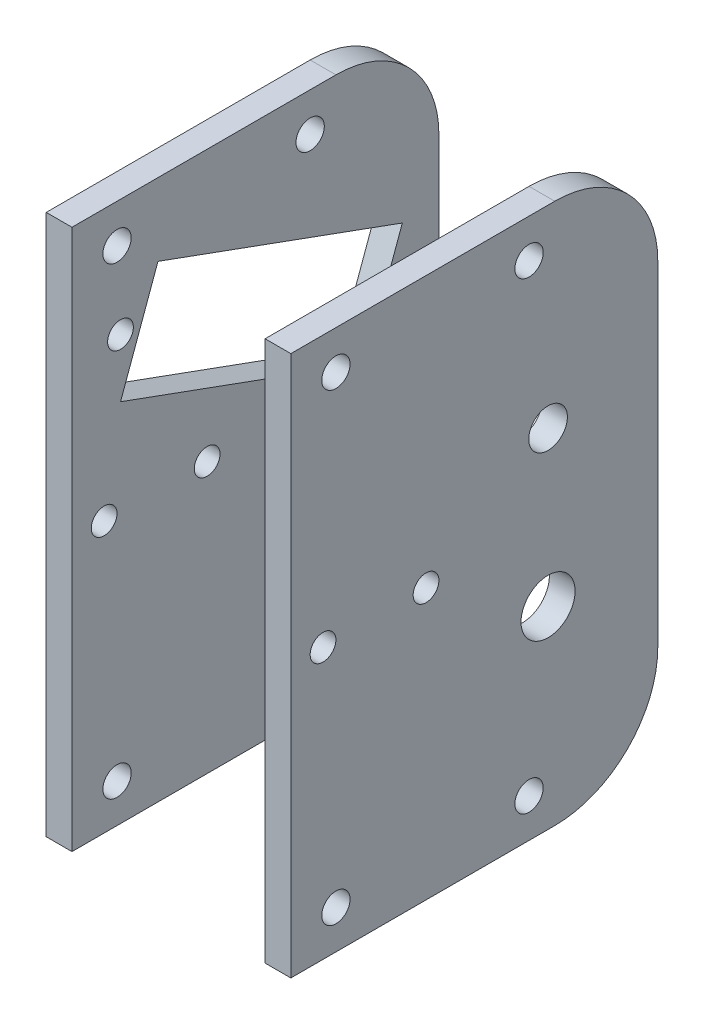
ISO-10303-21;
HEADER;
FILE_DESCRIPTION(('STEP AP214'),'2;1');
FILE_NAME('part.step','',(''),(''),'','','');
FILE_SCHEMA(('AUTOMOTIVE_DESIGN { 1 0 10303 214 1 1 1 1 }'));
ENDSEC;
DATA;
#1=APPLICATION_CONTEXT('core data for automotive mechanical design processes');
#2=APPLICATION_PROTOCOL_DEFINITION('international standard','automotive_design',2000,#1);
#3=PRODUCT_CONTEXT('',#1,'mechanical');
#4=PRODUCT('Part','Part','',(#3));
#5=PRODUCT_RELATED_PRODUCT_CATEGORY('part','',(#4));
#6=PRODUCT_DEFINITION_FORMATION('','',#4);
#7=PRODUCT_DEFINITION_CONTEXT('part definition',#1,'design');
#8=PRODUCT_DEFINITION('design','',#6,#7);
#9=PRODUCT_DEFINITION_SHAPE('','',#8);
#10=(LENGTH_UNIT() NAMED_UNIT(*) SI_UNIT(.MILLI.,.METRE.));
#11=(NAMED_UNIT(*) PLANE_ANGLE_UNIT() SI_UNIT($,.RADIAN.));
#12=(NAMED_UNIT(*) SI_UNIT($,.STERADIAN.) SOLID_ANGLE_UNIT());
#13=UNCERTAINTY_MEASURE_WITH_UNIT(LENGTH_MEASURE(1.E-05),#10,'distance_accuracy_value','');
#14=(GEOMETRIC_REPRESENTATION_CONTEXT(3) GLOBAL_UNCERTAINTY_ASSIGNED_CONTEXT((#13)) GLOBAL_UNIT_ASSIGNED_CONTEXT((#10,
#11,#12)) REPRESENTATION_CONTEXT('',''));
#15=CARTESIAN_POINT('',(0.,0.,0.));
#16=DIRECTION('',(0.,0.,1.));
#17=DIRECTION('',(1.,0.,0.));
#18=AXIS2_PLACEMENT_3D('',#15,#16,#17);
#19=CARTESIAN_POINT('',(7.5,19.,40.));
#20=DIRECTION('',(1.,0.,0.));
#21=DIRECTION('',(0.,1.,0.));
#22=AXIS2_PLACEMENT_3D('',#19,#20,#21);
#23=PLANE('',#22);
#24=CARTESIAN_POINT('',(7.49999999999999,-18.6124746070894,35.));
#25=DIRECTION('',(1.,0.,0.));
#26=DIRECTION('',(0.,0.,-1.));
#27=AXIS2_PLACEMENT_3D('',#24,#25,#26);
#28=CIRCLE('',#27,1.1);
#29=CARTESIAN_POINT('',(7.49999999999999,-18.6124746070894,33.9));
#30=VERTEX_POINT('',#29);
#31=EDGE_CURVE('P0_E148',#30,#30,#28,.T.);
#32=ORIENTED_EDGE('',*,*,#31,.T.);
#33=EDGE_LOOP('',(#32));
#34=FACE_BOUND('',#33,.T.);
#35=CARTESIAN_POINT('',(7.49999999999999,-6.61247460708938,18.5212057615986));
#36=DIRECTION('',(-1.,0.,0.));
#37=DIRECTION('',(0.,0.,1.));
#38=AXIS2_PLACEMENT_3D('',#35,#36,#37);
#39=CIRCLE('',#38,2.1);
#40=CARTESIAN_POINT('',(7.49999999999999,-6.61247460708938,20.6212057615986));
#41=VERTEX_POINT('',#40);
#42=EDGE_CURVE('P0_E80',#41,#41,#39,.F.);
#43=ORIENTED_EDGE('',*,*,#42,.T.);
#44=EDGE_LOOP('',(#43));
#45=FACE_BOUND('',#44,.T.);
#46=CARTESIAN_POINT('',(7.5,-0.612474607089377,36.));
#47=DIRECTION('',(1.,0.,0.));
#48=DIRECTION('',(0.,0.,-1.));
#49=AXIS2_PLACEMENT_3D('',#46,#47,#48);
#50=CIRCLE('',#49,1.);
#51=CARTESIAN_POINT('',(7.5,-0.612474607089377,35.));
#52=VERTEX_POINT('',#51);
#53=EDGE_CURVE('P0_E142',#52,#52,#50,.T.);
#54=ORIENTED_EDGE('',*,*,#53,.T.);
#55=EDGE_LOOP('',(#54));
#56=FACE_BOUND('',#55,.T.);
#57=CARTESIAN_POINT('',(7.5,-0.612474607089376,28.));
#58=DIRECTION('',(1.,0.,0.));
#59=DIRECTION('',(0.,0.,-1.));
#60=AXIS2_PLACEMENT_3D('',#57,#58,#59);
#61=CIRCLE('',#60,1.);
#62=CARTESIAN_POINT('',(7.5,-0.612474607089376,27.));
#63=VERTEX_POINT('',#62);
#64=EDGE_CURVE('P0_E145',#63,#63,#61,.T.);
#65=ORIENTED_EDGE('',*,*,#64,.T.);
#66=EDGE_LOOP('',(#65));
#67=FACE_BOUND('',#66,.T.);
#68=CARTESIAN_POINT('',(7.5,17.3875253929106,20.));
#69=DIRECTION('',(1.,0.,0.));
#70=DIRECTION('',(0.,0.,-1.));
#71=AXIS2_PLACEMENT_3D('',#68,#69,#70);
#72=CIRCLE('',#71,1.1);
#73=CARTESIAN_POINT('',(7.5,17.3875253929106,18.9));
#74=VERTEX_POINT('',#73);
#75=EDGE_CURVE('P0_E151',#74,#74,#72,.T.);
#76=ORIENTED_EDGE('',*,*,#75,.T.);
#77=EDGE_LOOP('',(#76));
#78=FACE_BOUND('',#77,.T.);
#79=CARTESIAN_POINT('',(7.5,17.3875253929106,35.));
#80=DIRECTION('',(1.,0.,0.));
#81=DIRECTION('',(0.,0.,-1.));
#82=AXIS2_PLACEMENT_3D('',#79,#80,#81);
#83=CIRCLE('',#82,1.1);
#84=CARTESIAN_POINT('',(7.5,17.3875253929106,33.9));
#85=VERTEX_POINT('',#84);
#86=EDGE_CURVE('P0_E156',#85,#85,#83,.T.);
#87=ORIENTED_EDGE('',*,*,#86,.T.);
#88=EDGE_LOOP('',(#87));
#89=FACE_BOUND('',#88,.T.);
#90=CARTESIAN_POINT('',(7.5,5.38752539291065,18.5212057615986));
#91=DIRECTION('',(1.,0.,0.));
#92=DIRECTION('',(0.,0.,-1.));
#93=AXIS2_PLACEMENT_3D('',#90,#91,#92);
#94=CIRCLE('',#93,1.5);
#95=CARTESIAN_POINT('',(7.5,5.38752539291065,17.0212057615986));
#96=VERTEX_POINT('',#95);
#97=EDGE_CURVE('P0_E20',#96,#96,#94,.T.);
#98=ORIENTED_EDGE('',*,*,#97,.T.);
#99=EDGE_LOOP('',(#98));
#100=FACE_BOUND('',#99,.T.);
#101=DIRECTION('',(0.,1.,0.));
#102=VECTOR('',#101,1.);
#103=CARTESIAN_POINT('',(7.49999999999999,-21.6124746070894,38.5));
#104=LINE('',#103,#102);
#105=CARTESIAN_POINT('',(7.49999999999999,-21.6124746070894,38.5));
#106=VERTEX_POINT('',#105);
#107=CARTESIAN_POINT('',(7.5,20.3875253929106,38.5));
#108=VERTEX_POINT('',#107);
#109=EDGE_CURVE('P0_E100',#106,#108,#104,.T.);
#110=ORIENTED_EDGE('',*,*,#109,.T.);
#111=DIRECTION('',(0.,0.,-1.));
#112=VECTOR('',#111,1.);
#113=CARTESIAN_POINT('',(7.5,20.3875253929106,10.));
#114=LINE('',#113,#112);
#115=CARTESIAN_POINT('',(7.5,20.3875253929106,18.));
#116=VERTEX_POINT('',#115);
#117=EDGE_CURVE('P0_E74',#108,#116,#114,.T.);
#118=ORIENTED_EDGE('',*,*,#117,.T.);
#119=CARTESIAN_POINT('',(7.49999999999999,12.3875253929106,18.));
#120=DIRECTION('',(-1.,0.,0.));
#121=DIRECTION('',(0.,0.,1.));
#122=AXIS2_PLACEMENT_3D('',#119,#120,#121);
#123=CIRCLE('',#122,8.);
#124=CARTESIAN_POINT('',(7.49999999999999,12.3875253929106,10.));
#125=VERTEX_POINT('',#124);
#126=EDGE_CURVE('P0_E68',#125,#116,#123,.F.);
#127=ORIENTED_EDGE('',*,*,#126,.F.);
#128=DIRECTION('',(0.,-1.,0.));
#129=VECTOR('',#128,1.);
#130=CARTESIAN_POINT('',(7.49999999999999,21.,10.));
#131=LINE('',#130,#129);
#132=CARTESIAN_POINT('',(7.5,-13.6124746070894,10.));
#133=VERTEX_POINT('',#132);
#134=EDGE_CURVE('P0_E72',#125,#133,#131,.T.);
#135=ORIENTED_EDGE('',*,*,#134,.T.);
#136=CARTESIAN_POINT('',(7.5,-13.6124746070894,18.));
#137=DIRECTION('',(-1.,0.,0.));
#138=DIRECTION('',(0.,0.,1.));
#139=AXIS2_PLACEMENT_3D('',#136,#137,#138);
#140=CIRCLE('',#139,8.);
#141=CARTESIAN_POINT('',(7.5,-21.6124746070894,18.));
#142=VERTEX_POINT('',#141);
#143=EDGE_CURVE('P0_E87',#142,#133,#140,.F.);
#144=ORIENTED_EDGE('',*,*,#143,.F.);
#145=DIRECTION('',(0.,0.,-1.));
#146=VECTOR('',#145,1.);
#147=CARTESIAN_POINT('',(7.49999999999999,-21.6124746070894,10.));
#148=LINE('',#147,#146);
#149=EDGE_CURVE('P0_E106',#106,#142,#148,.T.);
#150=ORIENTED_EDGE('',*,*,#149,.F.);
#151=EDGE_LOOP('',(#110,#118,#127,#135,#144,#150));
#152=FACE_BOUND('',#151,.T.);
#153=CARTESIAN_POINT('',(7.49999999999999,-18.6124746070894,20.));
#154=DIRECTION('',(1.,0.,0.));
#155=DIRECTION('',(0.,0.,-1.));
#156=AXIS2_PLACEMENT_3D('',#153,#154,#155);
#157=CIRCLE('',#156,1.1);
#158=CARTESIAN_POINT('',(7.49999999999999,-18.6124746070894,18.9));
#159=VERTEX_POINT('',#158);
#160=EDGE_CURVE('P0_E154',#159,#159,#157,.T.);
#161=ORIENTED_EDGE('',*,*,#160,.T.);
#162=EDGE_LOOP('',(#161));
#163=FACE_BOUND('',#162,.T.);
#164=ADVANCED_FACE('P0_F17',(#34,#45,#56,#67,#78,#89,#100,#152,#163),#23,.F.);
#165=CARTESIAN_POINT('',(6.5,5.38752539291065,18.5212057615986));
#166=DIRECTION('',(1.,0.,0.));
#167=DIRECTION('',(0.,0.,-1.));
#168=AXIS2_PLACEMENT_3D('',#165,#166,#167);
#169=CYLINDRICAL_SURFACE('',#168,1.5);
#170=ORIENTED_EDGE('',*,*,#97,.F.);
#171=EDGE_LOOP('',(#170));
#172=FACE_BOUND('',#171,.T.);
#173=CARTESIAN_POINT('',(9.5,5.38752539291065,18.5212057615986));
#174=DIRECTION('',(1.,0.,0.));
#175=DIRECTION('',(0.,0.,-1.));
#176=AXIS2_PLACEMENT_3D('',#173,#174,#175);
#177=CIRCLE('',#176,1.5);
#178=CARTESIAN_POINT('',(9.5,5.38752539291065,17.0212057615986));
#179=VERTEX_POINT('',#178);
#180=EDGE_CURVE('P0_E97',#179,#179,#177,.T.);
#181=ORIENTED_EDGE('',*,*,#180,.T.);
#182=EDGE_LOOP('',(#181));
#183=FACE_BOUND('',#182,.T.);
#184=ADVANCED_FACE('P0_F164',(#172,#183),#169,.F.);
#185=CARTESIAN_POINT('',(-9.5,17.3875253929106,35.));
#186=DIRECTION('',(1.,0.,0.));
#187=DIRECTION('',(0.,0.,-1.));
#188=AXIS2_PLACEMENT_3D('',#185,#186,#187);
#189=CYLINDRICAL_SURFACE('',#188,1.1);
#190=ORIENTED_EDGE('',*,*,#86,.F.);
#191=EDGE_LOOP('',(#190));
#192=FACE_BOUND('',#191,.T.);
#193=CARTESIAN_POINT('',(9.5,17.3875253929106,35.));
#194=DIRECTION('',(1.,0.,0.));
#195=DIRECTION('',(0.,0.,-1.));
#196=AXIS2_PLACEMENT_3D('',#193,#194,#195);
#197=CIRCLE('',#196,1.1);
#198=CARTESIAN_POINT('',(9.5,17.3875253929106,33.9));
#199=VERTEX_POINT('',#198);
#200=EDGE_CURVE('P0_E134',#199,#199,#197,.T.);
#201=ORIENTED_EDGE('',*,*,#200,.T.);
#202=EDGE_LOOP('',(#201));
#203=FACE_BOUND('',#202,.T.);
#204=ADVANCED_FACE('P0_F167',(#192,#203),#189,.F.);
#205=CARTESIAN_POINT('',(-9.5,-18.6124746070894,20.));
#206=DIRECTION('',(1.,0.,0.));
#207=DIRECTION('',(0.,0.,-1.));
#208=AXIS2_PLACEMENT_3D('',#205,#206,#207);
#209=CYLINDRICAL_SURFACE('',#208,1.1);
#210=ORIENTED_EDGE('',*,*,#160,.F.);
#211=EDGE_LOOP('',(#210));
#212=FACE_BOUND('',#211,.T.);
#213=CARTESIAN_POINT('',(9.5,-18.6124746070894,20.));
#214=DIRECTION('',(1.,0.,0.));
#215=DIRECTION('',(0.,0.,-1.));
#216=AXIS2_PLACEMENT_3D('',#213,#214,#215);
#217=CIRCLE('',#216,1.1);
#218=CARTESIAN_POINT('',(9.5,-18.6124746070894,18.9));
#219=VERTEX_POINT('',#218);
#220=EDGE_CURVE('P0_E131',#219,#219,#217,.T.);
#221=ORIENTED_EDGE('',*,*,#220,.T.);
#222=EDGE_LOOP('',(#221));
#223=FACE_BOUND('',#222,.T.);
#224=ADVANCED_FACE('P0_F218',(#212,#223),#209,.F.);
#225=CARTESIAN_POINT('',(-9.5,17.3875253929106,20.));
#226=DIRECTION('',(1.,0.,0.));
#227=DIRECTION('',(0.,0.,-1.));
#228=AXIS2_PLACEMENT_3D('',#225,#226,#227);
#229=CYLINDRICAL_SURFACE('',#228,1.1);
#230=ORIENTED_EDGE('',*,*,#75,.F.);
#231=EDGE_LOOP('',(#230));
#232=FACE_BOUND('',#231,.T.);
#233=CARTESIAN_POINT('',(9.5,17.3875253929106,20.));
#234=DIRECTION('',(1.,0.,0.));
#235=DIRECTION('',(0.,0.,-1.));
#236=AXIS2_PLACEMENT_3D('',#233,#234,#235);
#237=CIRCLE('',#236,1.1);
#238=CARTESIAN_POINT('',(9.5,17.3875253929106,18.9));
#239=VERTEX_POINT('',#238);
#240=EDGE_CURVE('P0_E128',#239,#239,#237,.T.);
#241=ORIENTED_EDGE('',*,*,#240,.T.);
#242=EDGE_LOOP('',(#241));
#243=FACE_BOUND('',#242,.T.);
#244=ADVANCED_FACE('P0_F214',(#232,#243),#229,.F.);
#245=CARTESIAN_POINT('',(-9.5,-18.6124746070894,35.));
#246=DIRECTION('',(1.,0.,0.));
#247=DIRECTION('',(0.,0.,-1.));
#248=AXIS2_PLACEMENT_3D('',#245,#246,#247);
#249=CYLINDRICAL_SURFACE('',#248,1.1);
#250=ORIENTED_EDGE('',*,*,#31,.F.);
#251=EDGE_LOOP('',(#250));
#252=FACE_BOUND('',#251,.T.);
#253=CARTESIAN_POINT('',(9.5,-18.6124746070894,35.));
#254=DIRECTION('',(1.,0.,0.));
#255=DIRECTION('',(0.,0.,-1.));
#256=AXIS2_PLACEMENT_3D('',#253,#254,#255);
#257=CIRCLE('',#256,1.1);
#258=CARTESIAN_POINT('',(9.5,-18.6124746070894,33.9));
#259=VERTEX_POINT('',#258);
#260=EDGE_CURVE('P0_E125',#259,#259,#257,.T.);
#261=ORIENTED_EDGE('',*,*,#260,.T.);
#262=EDGE_LOOP('',(#261));
#263=FACE_BOUND('',#262,.T.);
#264=ADVANCED_FACE('P0_F210',(#252,#263),#249,.F.);
#265=CARTESIAN_POINT('',(-9.5,-0.612474607089376,28.));
#266=DIRECTION('',(1.,0.,0.));
#267=DIRECTION('',(0.,0.,-1.));
#268=AXIS2_PLACEMENT_3D('',#265,#266,#267);
#269=CYLINDRICAL_SURFACE('',#268,1.);
#270=ORIENTED_EDGE('',*,*,#64,.F.);
#271=EDGE_LOOP('',(#270));
#272=FACE_BOUND('',#271,.T.);
#273=CARTESIAN_POINT('',(9.5,-0.612474607089376,28.));
#274=DIRECTION('',(1.,0.,0.));
#275=DIRECTION('',(0.,0.,-1.));
#276=AXIS2_PLACEMENT_3D('',#273,#274,#275);
#277=CIRCLE('',#276,1.);
#278=CARTESIAN_POINT('',(9.5,-0.612474607089376,27.));
#279=VERTEX_POINT('',#278);
#280=EDGE_CURVE('P0_E122',#279,#279,#277,.T.);
#281=ORIENTED_EDGE('',*,*,#280,.T.);
#282=EDGE_LOOP('',(#281));
#283=FACE_BOUND('',#282,.T.);
#284=ADVANCED_FACE('P0_F206',(#272,#283),#269,.F.);
#285=CARTESIAN_POINT('',(-9.5,-0.612474607089377,36.));
#286=DIRECTION('',(1.,0.,0.));
#287=DIRECTION('',(0.,0.,-1.));
#288=AXIS2_PLACEMENT_3D('',#285,#286,#287);
#289=CYLINDRICAL_SURFACE('',#288,1.);
#290=ORIENTED_EDGE('',*,*,#53,.F.);
#291=EDGE_LOOP('',(#290));
#292=FACE_BOUND('',#291,.T.);
#293=CARTESIAN_POINT('',(9.5,-0.612474607089377,36.));
#294=DIRECTION('',(1.,0.,0.));
#295=DIRECTION('',(0.,0.,-1.));
#296=AXIS2_PLACEMENT_3D('',#293,#294,#295);
#297=CIRCLE('',#296,1.);
#298=CARTESIAN_POINT('',(9.5,-0.612474607089377,35.));
#299=VERTEX_POINT('',#298);
#300=EDGE_CURVE('P0_E119',#299,#299,#297,.T.);
#301=ORIENTED_EDGE('',*,*,#300,.T.);
#302=EDGE_LOOP('',(#301));
#303=FACE_BOUND('',#302,.T.);
#304=ADVANCED_FACE('P0_F202',(#292,#303),#289,.F.);
#305=CARTESIAN_POINT('',(9.5,-6.61247460708938,18.5212057615986));
#306=DIRECTION('',(-1.,0.,0.));
#307=DIRECTION('',(0.,0.,1.));
#308=AXIS2_PLACEMENT_3D('',#305,#306,#307);
#309=CYLINDRICAL_SURFACE('',#308,2.1);
#310=CARTESIAN_POINT('',(9.5,-6.61247460708938,18.5212057615986));
#311=DIRECTION('',(-1.,0.,0.));
#312=DIRECTION('',(0.,0.,1.));
#313=AXIS2_PLACEMENT_3D('',#310,#311,#312);
#314=CIRCLE('',#313,2.1);
#315=CARTESIAN_POINT('',(9.5,-6.61247460708938,20.6212057615986));
#316=VERTEX_POINT('',#315);
#317=EDGE_CURVE('P0_E116',#316,#316,#314,.F.);
#318=ORIENTED_EDGE('',*,*,#317,.T.);
#319=EDGE_LOOP('',(#318));
#320=FACE_BOUND('',#319,.T.);
#321=ORIENTED_EDGE('',*,*,#42,.F.);
#322=EDGE_LOOP('',(#321));
#323=FACE_BOUND('',#322,.T.);
#324=ADVANCED_FACE('P0_F199',(#320,#323),#309,.F.);
#325=CARTESIAN_POINT('',(9.5,12.3875253929106,18.));
#326=DIRECTION('',(-1.,0.,0.));
#327=DIRECTION('',(0.,0.,1.));
#328=AXIS2_PLACEMENT_3D('',#325,#326,#327);
#329=CYLINDRICAL_SURFACE('',#328,8.);
#330=CARTESIAN_POINT('',(9.5,12.3875253929106,18.));
#331=DIRECTION('',(-1.,0.,0.));
#332=DIRECTION('',(0.,0.,1.));
#333=AXIS2_PLACEMENT_3D('',#330,#331,#332);
#334=CIRCLE('',#333,8.);
#335=CARTESIAN_POINT('',(9.5,20.3875253929106,18.));
#336=VERTEX_POINT('',#335);
#337=CARTESIAN_POINT('',(9.5,12.3875253929106,10.));
#338=VERTEX_POINT('',#337);
#339=EDGE_CURVE('P0_E91',#336,#338,#334,.T.);
#340=ORIENTED_EDGE('',*,*,#339,.T.);
#341=DIRECTION('',(1.,0.,0.));
#342=VECTOR('',#341,1.);
#343=CARTESIAN_POINT('',(-9.5,12.3875253929106,10.));
#344=LINE('',#343,#342);
#345=EDGE_CURVE('P0_E79',#338,#125,#344,.F.);
#346=ORIENTED_EDGE('',*,*,#345,.T.);
#347=ORIENTED_EDGE('',*,*,#126,.T.);
#348=DIRECTION('',(1.,0.,0.));
#349=VECTOR('',#348,1.);
#350=CARTESIAN_POINT('',(9.501,20.3875253929106,18.));
#351=LINE('',#350,#349);
#352=EDGE_CURVE('P0_E367',#116,#336,#351,.T.);
#353=ORIENTED_EDGE('',*,*,#352,.T.);
#354=EDGE_LOOP('',(#340,#346,#347,#353));
#355=FACE_BOUND('',#354,.T.);
#356=ADVANCED_FACE('P0_F90',(#355),#329,.T.);
#357=CARTESIAN_POINT('',(-9.5,21.,10.));
#358=DIRECTION('',(0.,0.,1.));
#359=DIRECTION('',(0.,-1.,0.));
#360=AXIS2_PLACEMENT_3D('',#357,#358,#359);
#361=PLANE('',#360);
#362=ORIENTED_EDGE('',*,*,#134,.F.);
#363=ORIENTED_EDGE('',*,*,#345,.F.);
#364=DIRECTION('',(0.,1.,0.));
#365=VECTOR('',#364,1.);
#366=CARTESIAN_POINT('',(9.5,-21.,10.));
#367=LINE('',#366,#365);
#368=CARTESIAN_POINT('',(9.5,-13.6124746070894,10.));
#369=VERTEX_POINT('',#368);
#370=EDGE_CURVE('P0_E114',#338,#369,#367,.F.);
#371=ORIENTED_EDGE('',*,*,#370,.T.);
#372=DIRECTION('',(-1.,0.,0.));
#373=VECTOR('',#372,1.);
#374=CARTESIAN_POINT('',(9.5,-13.6124746070894,10.));
#375=LINE('',#374,#373);
#376=EDGE_CURVE('P0_E86',#133,#369,#375,.F.);
#377=ORIENTED_EDGE('',*,*,#376,.F.);
#378=EDGE_LOOP('',(#362,#363,#371,#377));
#379=FACE_BOUND('',#378,.T.);
#380=ADVANCED_FACE('P0_F83',(#379),#361,.F.);
#381=CARTESIAN_POINT('',(9.5,-13.6124746070894,18.));
#382=DIRECTION('',(-1.,0.,0.));
#383=DIRECTION('',(0.,0.,1.));
#384=AXIS2_PLACEMENT_3D('',#381,#382,#383);
#385=CYLINDRICAL_SURFACE('',#384,8.);
#386=ORIENTED_EDGE('',*,*,#376,.T.);
#387=CARTESIAN_POINT('',(9.5,-13.6124746070894,18.));
#388=DIRECTION('',(-1.,0.,0.));
#389=DIRECTION('',(0.,0.,1.));
#390=AXIS2_PLACEMENT_3D('',#387,#388,#389);
#391=CIRCLE('',#390,8.);
#392=CARTESIAN_POINT('',(9.5,-21.6124746070894,18.));
#393=VERTEX_POINT('',#392);
#394=EDGE_CURVE('P0_E110',#369,#393,#391,.T.);
#395=ORIENTED_EDGE('',*,*,#394,.T.);
#396=DIRECTION('',(1.,0.,0.));
#397=VECTOR('',#396,1.);
#398=CARTESIAN_POINT('',(39.5062514343983,-21.6124746070894,18.));
#399=LINE('',#398,#397);
#400=EDGE_CURVE('P0_E103',#142,#393,#399,.T.);
#401=ORIENTED_EDGE('',*,*,#400,.F.);
#402=ORIENTED_EDGE('',*,*,#143,.T.);
#403=EDGE_LOOP('',(#386,#395,#401,#402));
#404=FACE_BOUND('',#403,.T.);
#405=ADVANCED_FACE('P0_F190',(#404),#385,.T.);
#406=CARTESIAN_POINT('',(39.5062514343983,-21.6124746070894,10.));
#407=DIRECTION('',(0.,-1.,0.));
#408=DIRECTION('',(0.,0.,-1.));
#409=AXIS2_PLACEMENT_3D('',#406,#407,#408);
#410=PLANE('',#409);
#411=ORIENTED_EDGE('',*,*,#400,.T.);
#412=DIRECTION('',(0.,0.,1.));
#413=VECTOR('',#412,1.);
#414=CARTESIAN_POINT('',(9.5,-21.6124746070894,40.));
#415=LINE('',#414,#413);
#416=CARTESIAN_POINT('',(9.5,-21.6124746070894,38.5));
#417=VERTEX_POINT('',#416);
#418=EDGE_CURVE('P0_E113',#393,#417,#415,.T.);
#419=ORIENTED_EDGE('',*,*,#418,.T.);
#420=DIRECTION('',(-1.,0.,0.));
#421=VECTOR('',#420,1.);
#422=CARTESIAN_POINT('',(9.5,-21.6124746070894,38.5));
#423=LINE('',#422,#421);
#424=EDGE_CURVE('P0_E102',#417,#106,#423,.T.);
#425=ORIENTED_EDGE('',*,*,#424,.T.);
#426=ORIENTED_EDGE('',*,*,#149,.T.);
#427=EDGE_LOOP('',(#411,#419,#425,#426));
#428=FACE_BOUND('',#427,.T.);
#429=ADVANCED_FACE('P0_F186',(#428),#410,.T.);
#430=CARTESIAN_POINT('',(9.5,-21.6124746070894,38.5));
#431=DIRECTION('',(0.,0.,-1.));
#432=DIRECTION('',(-1.,0.,0.));
#433=AXIS2_PLACEMENT_3D('',#430,#431,#432);
#434=PLANE('',#433);
#435=DIRECTION('',(0.,1.,0.));
#436=VECTOR('',#435,1.);
#437=CARTESIAN_POINT('',(9.5,-21.,38.5));
#438=LINE('',#437,#436);
#439=CARTESIAN_POINT('',(9.5,20.3875253929106,38.5));
#440=VERTEX_POINT('',#439);
#441=EDGE_CURVE('P0_E26',#417,#440,#438,.T.);
#442=ORIENTED_EDGE('',*,*,#441,.T.);
#443=DIRECTION('',(1.,0.,0.));
#444=VECTOR('',#443,1.);
#445=CARTESIAN_POINT('',(9.501,20.3875253929106,38.5));
#446=LINE('',#445,#444);
#447=EDGE_CURVE('P0_E34',#440,#108,#446,.F.);
#448=ORIENTED_EDGE('',*,*,#447,.T.);
#449=ORIENTED_EDGE('',*,*,#109,.F.);
#450=ORIENTED_EDGE('',*,*,#424,.F.);
#451=EDGE_LOOP('',(#442,#448,#449,#450));
#452=FACE_BOUND('',#451,.T.);
#453=ADVANCED_FACE('P0_F179',(#452),#434,.F.);
#454=CARTESIAN_POINT('',(9.501,20.3875253929106,10.));
#455=DIRECTION('',(0.,-1.,0.));
#456=DIRECTION('',(0.,0.,-1.));
#457=AXIS2_PLACEMENT_3D('',#454,#455,#456);
#458=PLANE('',#457);
#459=ORIENTED_EDGE('',*,*,#447,.F.);
#460=DIRECTION('',(0.,0.,1.));
#461=VECTOR('',#460,1.);
#462=CARTESIAN_POINT('',(9.5,20.3875253929106,40.));
#463=LINE('',#462,#461);
#464=EDGE_CURVE('P0_E11',#440,#336,#463,.F.);
#465=ORIENTED_EDGE('',*,*,#464,.T.);
#466=ORIENTED_EDGE('',*,*,#352,.F.);
#467=ORIENTED_EDGE('',*,*,#117,.F.);
#468=EDGE_LOOP('',(#459,#465,#466,#467));
#469=FACE_BOUND('',#468,.T.);
#470=ADVANCED_FACE('P0_F172',(#469),#458,.F.);
#471=CARTESIAN_POINT('',(9.5,-21.,40.));
#472=DIRECTION('',(-1.,0.,0.));
#473=DIRECTION('',(0.,0.,1.));
#474=AXIS2_PLACEMENT_3D('',#471,#472,#473);
#475=PLANE('',#474);
#476=ORIENTED_EDGE('',*,*,#441,.F.);
#477=ORIENTED_EDGE('',*,*,#418,.F.);
#478=ORIENTED_EDGE('',*,*,#394,.F.);
#479=ORIENTED_EDGE('',*,*,#370,.F.);
#480=ORIENTED_EDGE('',*,*,#339,.F.);
#481=ORIENTED_EDGE('',*,*,#464,.F.);
#482=EDGE_LOOP('',(#476,#477,#478,#479,#480,#481));
#483=FACE_BOUND('',#482,.T.);
#484=ORIENTED_EDGE('',*,*,#317,.F.);
#485=EDGE_LOOP('',(#484));
#486=FACE_BOUND('',#485,.T.);
#487=ORIENTED_EDGE('',*,*,#300,.F.);
#488=EDGE_LOOP('',(#487));
#489=FACE_BOUND('',#488,.T.);
#490=ORIENTED_EDGE('',*,*,#280,.F.);
#491=EDGE_LOOP('',(#490));
#492=FACE_BOUND('',#491,.T.);
#493=ORIENTED_EDGE('',*,*,#260,.F.);
#494=EDGE_LOOP('',(#493));
#495=FACE_BOUND('',#494,.T.);
#496=ORIENTED_EDGE('',*,*,#240,.F.);
#497=EDGE_LOOP('',(#496));
#498=FACE_BOUND('',#497,.T.);
#499=ORIENTED_EDGE('',*,*,#220,.F.);
#500=EDGE_LOOP('',(#499));
#501=FACE_BOUND('',#500,.T.);
#502=ORIENTED_EDGE('',*,*,#200,.F.);
#503=EDGE_LOOP('',(#502));
#504=FACE_BOUND('',#503,.T.);
#505=ORIENTED_EDGE('',*,*,#180,.F.);
#506=EDGE_LOOP('',(#505));
#507=FACE_BOUND('',#506,.T.);
#508=ADVANCED_FACE('P0_F170',(#483,#486,#489,#492,#495,#498,#501,#504,#507),#475,.F.);
#509=CLOSED_SHELL('',(#164,#184,#204,#224,#244,#264,#284,#304,#324,#356,#380,#405,#429,#453,
#470,#508));
#510=MANIFOLD_SOLID_BREP('P0_B1',#509);
#511=CARTESIAN_POINT('',(-9.5,-21.,40.));
#512=DIRECTION('',(1.,0.,0.));
#513=DIRECTION('',(0.,0.,-1.));
#514=AXIS2_PLACEMENT_3D('',#511,#512,#513);
#515=PLANE('',#514);
#516=CARTESIAN_POINT('',(-9.5,-6.61247460708938,18.5212057615986));
#517=DIRECTION('',(-1.,0.,0.));
#518=DIRECTION('',(0.,0.,1.));
#519=AXIS2_PLACEMENT_3D('',#516,#517,#518);
#520=CIRCLE('',#519,1.5);
#521=CARTESIAN_POINT('',(-9.5,-6.61247460708938,20.0212057615986));
#522=VERTEX_POINT('',#521);
#523=EDGE_CURVE('P1_E168',#522,#522,#520,.F.);
#524=ORIENTED_EDGE('',*,*,#523,.T.);
#525=EDGE_LOOP('',(#524));
#526=FACE_BOUND('',#525,.T.);
#527=DIRECTION('',(0.,1.,0.));
#528=VECTOR('',#527,1.);
#529=CARTESIAN_POINT('',(-9.5,-21.6124746070894,38.5));
#530=LINE('',#529,#528);
#531=CARTESIAN_POINT('',(-9.5,-21.6124746070894,38.5));
#532=VERTEX_POINT('',#531);
#533=CARTESIAN_POINT('',(-9.5,20.3875253929106,38.5));
#534=VERTEX_POINT('',#533);
#535=EDGE_CURVE('P1_E125',#532,#534,#530,.T.);
#536=ORIENTED_EDGE('',*,*,#535,.T.);
#537=DIRECTION('',(0.,0.,-1.));
#538=VECTOR('',#537,1.);
#539=CARTESIAN_POINT('',(-9.5,20.3875253929106,10.));
#540=LINE('',#539,#538);
#541=CARTESIAN_POINT('',(-9.5,20.3875253929106,18.));
#542=VERTEX_POINT('',#541);
#543=EDGE_CURVE('P1_E100',#534,#542,#540,.T.);
#544=ORIENTED_EDGE('',*,*,#543,.T.);
#545=CARTESIAN_POINT('',(-9.5,12.3875253929106,18.));
#546=DIRECTION('',(-1.,0.,0.));
#547=DIRECTION('',(0.,0.,1.));
#548=AXIS2_PLACEMENT_3D('',#545,#546,#547);
#549=CIRCLE('',#548,8.);
#550=CARTESIAN_POINT('',(-9.5,12.3875253929106,10.));
#551=VERTEX_POINT('',#550);
#552=EDGE_CURVE('P1_E93',#551,#542,#549,.F.);
#553=ORIENTED_EDGE('',*,*,#552,.F.);
#554=DIRECTION('',(0.,-1.,0.));
#555=VECTOR('',#554,1.);
#556=CARTESIAN_POINT('',(-9.5,21.,10.));
#557=LINE('',#556,#555);
#558=CARTESIAN_POINT('',(-9.5,-13.6124746070894,10.));
#559=VERTEX_POINT('',#558);
#560=EDGE_CURVE('P1_E97',#551,#559,#557,.T.);
#561=ORIENTED_EDGE('',*,*,#560,.T.);
#562=CARTESIAN_POINT('',(-9.5,-13.6124746070894,18.));
#563=DIRECTION('',(-1.,0.,0.));
#564=DIRECTION('',(0.,0.,1.));
#565=AXIS2_PLACEMENT_3D('',#562,#563,#564);
#566=CIRCLE('',#565,8.);
#567=CARTESIAN_POINT('',(-9.5,-21.6124746070894,18.));
#568=VERTEX_POINT('',#567);
#569=EDGE_CURVE('P1_E111',#568,#559,#566,.F.);
#570=ORIENTED_EDGE('',*,*,#569,.F.);
#571=DIRECTION('',(0.,0.,-1.));
#572=VECTOR('',#571,1.);
#573=CARTESIAN_POINT('',(-9.5,-21.6124746070894,10.));
#574=LINE('',#573,#572);
#575=EDGE_CURVE('P1_E131',#532,#568,#574,.T.);
#576=ORIENTED_EDGE('',*,*,#575,.F.);
#577=EDGE_LOOP('',(#536,#544,#553,#561,#570,#576));
#578=FACE_BOUND('',#577,.T.);
#579=CARTESIAN_POINT('',(-9.5,11.2874733681532,34.7311795995345));
#580=DIRECTION('',(-1.,0.,0.));
#581=DIRECTION('',(0.,0.,1.));
#582=AXIS2_PLACEMENT_3D('',#579,#580,#581);
#583=CIRCLE('',#582,1.00000000000001);
#584=CARTESIAN_POINT('',(-9.5,11.2874733681532,35.7311795995345));
#585=VERTEX_POINT('',#584);
#586=EDGE_CURVE('P1_E174',#585,#585,#583,.F.);
#587=ORIENTED_EDGE('',*,*,#586,.T.);
#588=EDGE_LOOP('',(#587));
#589=FACE_BOUND('',#588,.T.);
#590=DIRECTION('',(0.,0.939692620785908,-0.34202014332567));
#591=VECTOR('',#590,1.);
#592=CARTESIAN_POINT('',(-9.50000000000001,-0.145158387520231,15.7464507065751));
#593=LINE('',#592,#591);
#594=CARTESIAN_POINT('',(-9.50000000000001,-0.145158387520231,15.7464507065751));
#595=VERTEX_POINT('',#594);
#596=CARTESIAN_POINT('',(-9.50000000000001,7.84222888915999,12.8392794883069));
#597=VERTEX_POINT('',#596);
#598=EDGE_CURVE('P1_E214',#595,#597,#593,.T.);
#599=ORIENTED_EDGE('',*,*,#598,.T.);
#600=DIRECTION('',(0.,0.34202014332567,0.939692620785908));
#601=VECTOR('',#600,1.);
#602=CARTESIAN_POINT('',(-9.50000000000001,7.84222888915999,12.8392794883069));
#603=LINE('',#602,#601);
#604=CARTESIAN_POINT('',(-9.50000000000001,14.7510357843385,31.8210704281823));
#605=VERTEX_POINT('',#604);
#606=EDGE_CURVE('P1_E210',#597,#605,#603,.T.);
#607=ORIENTED_EDGE('',*,*,#606,.T.);
#608=DIRECTION('',(0.,-0.939692620785908,0.34202014332567));
#609=VECTOR('',#608,1.);
#610=CARTESIAN_POINT('',(-9.50000000000001,14.7510357843385,31.8210704281823));
#611=LINE('',#610,#609);
#612=CARTESIAN_POINT('',(-9.50000000000001,6.7636485076583,34.7282416464505));
#613=VERTEX_POINT('',#612);
#614=EDGE_CURVE('P1_E181',#605,#613,#611,.T.);
#615=ORIENTED_EDGE('',*,*,#614,.T.);
#616=DIRECTION('',(0.,-0.34202014332567,-0.939692620785908));
#617=VECTOR('',#616,1.);
#618=CARTESIAN_POINT('',(-9.50000000000001,6.7636485076583,34.7282416464505));
#619=LINE('',#618,#617);
#620=EDGE_CURVE('P1_E219',#613,#595,#619,.T.);
#621=ORIENTED_EDGE('',*,*,#620,.T.);
#622=EDGE_LOOP('',(#599,#607,#615,#621));
#623=FACE_BOUND('',#622,.T.);
#624=CARTESIAN_POINT('',(-9.5,3.24999999999996,12.6484030110657));
#625=DIRECTION('',(-1.,0.,0.));
#626=DIRECTION('',(0.,0.,1.));
#627=AXIS2_PLACEMENT_3D('',#624,#625,#626);
#628=CIRCLE('',#627,1.);
#629=CARTESIAN_POINT('',(-9.5,3.24999999999996,13.6484030110657));
#630=VERTEX_POINT('',#629);
#631=EDGE_CURVE('P1_E178',#630,#630,#628,.F.);
#632=ORIENTED_EDGE('',*,*,#631,.T.);
#633=EDGE_LOOP('',(#632));
#634=FACE_BOUND('',#633,.T.);
#635=CARTESIAN_POINT('',(-9.5,-0.612474607089377,36.));
#636=DIRECTION('',(1.,0.,0.));
#637=DIRECTION('',(0.,0.,-1.));
#638=AXIS2_PLACEMENT_3D('',#635,#636,#637);
#639=CIRCLE('',#638,1.);
#640=CARTESIAN_POINT('',(-9.5,-0.612474607089377,35.));
#641=VERTEX_POINT('',#640);
#642=EDGE_CURVE('P1_E182',#641,#641,#639,.T.);
#643=ORIENTED_EDGE('',*,*,#642,.T.);
#644=EDGE_LOOP('',(#643));
#645=FACE_BOUND('',#644,.T.);
#646=CARTESIAN_POINT('',(-9.5,-0.612474607089376,28.));
#647=DIRECTION('',(1.,0.,0.));
#648=DIRECTION('',(0.,0.,-1.));
#649=AXIS2_PLACEMENT_3D('',#646,#647,#648);
#650=CIRCLE('',#649,1.);
#651=CARTESIAN_POINT('',(-9.5,-0.612474607089376,27.));
#652=VERTEX_POINT('',#651);
#653=EDGE_CURVE('P1_E185',#652,#652,#650,.T.);
#654=ORIENTED_EDGE('',*,*,#653,.T.);
#655=EDGE_LOOP('',(#654));
#656=FACE_BOUND('',#655,.T.);
#657=CARTESIAN_POINT('',(-9.5,-18.6124746070894,35.));
#658=DIRECTION('',(1.,0.,0.));
#659=DIRECTION('',(0.,0.,-1.));
#660=AXIS2_PLACEMENT_3D('',#657,#658,#659);
#661=CIRCLE('',#660,1.1);
#662=CARTESIAN_POINT('',(-9.5,-18.6124746070894,33.9));
#663=VERTEX_POINT('',#662);
#664=EDGE_CURVE('P1_E171',#663,#663,#661,.T.);
#665=ORIENTED_EDGE('',*,*,#664,.T.);
#666=EDGE_LOOP('',(#665));
#667=FACE_BOUND('',#666,.T.);
#668=CARTESIAN_POINT('',(-9.5,17.3875253929106,20.));
#669=DIRECTION('',(1.,0.,0.));
#670=DIRECTION('',(0.,0.,-1.));
#671=AXIS2_PLACEMENT_3D('',#668,#669,#670);
#672=CIRCLE('',#671,1.1);
#673=CARTESIAN_POINT('',(-9.5,17.3875253929106,18.9));
#674=VERTEX_POINT('',#673);
#675=EDGE_CURVE('P1_E188',#674,#674,#672,.T.);
#676=ORIENTED_EDGE('',*,*,#675,.T.);
#677=EDGE_LOOP('',(#676));
#678=FACE_BOUND('',#677,.T.);
#679=CARTESIAN_POINT('',(-9.5,-18.6124746070894,20.));
#680=DIRECTION('',(1.,0.,0.));
#681=DIRECTION('',(0.,0.,-1.));
#682=AXIS2_PLACEMENT_3D('',#679,#680,#681);
#683=CIRCLE('',#682,1.1);
#684=CARTESIAN_POINT('',(-9.5,-18.6124746070894,18.9));
#685=VERTEX_POINT('',#684);
#686=EDGE_CURVE('P1_E20',#685,#685,#683,.T.);
#687=ORIENTED_EDGE('',*,*,#686,.T.);
#688=EDGE_LOOP('',(#687));
#689=FACE_BOUND('',#688,.T.);
#690=CARTESIAN_POINT('',(-9.5,17.3875253929106,35.));
#691=DIRECTION('',(1.,0.,0.));
#692=DIRECTION('',(0.,0.,-1.));
#693=AXIS2_PLACEMENT_3D('',#690,#691,#692);
#694=CIRCLE('',#693,1.1);
#695=CARTESIAN_POINT('',(-9.5,17.3875253929106,33.9));
#696=VERTEX_POINT('',#695);
#697=EDGE_CURVE('P1_E121',#696,#696,#694,.T.);
#698=ORIENTED_EDGE('',*,*,#697,.T.);
#699=EDGE_LOOP('',(#698));
#700=FACE_BOUND('',#699,.T.);
#701=ADVANCED_FACE('P1_F17',(#526,#578,#589,#623,#634,#645,#656,#667,#678,#689,#700),#515,.F.);
#702=CARTESIAN_POINT('',(-9.5,-18.6124746070894,20.));
#703=DIRECTION('',(1.,0.,0.));
#704=DIRECTION('',(0.,0.,-1.));
#705=AXIS2_PLACEMENT_3D('',#702,#703,#704);
#706=CYLINDRICAL_SURFACE('',#705,1.1);
#707=CARTESIAN_POINT('',(-7.50000000000001,-18.6124746070894,20.));
#708=DIRECTION('',(1.,0.,0.));
#709=DIRECTION('',(0.,0.,-1.));
#710=AXIS2_PLACEMENT_3D('',#707,#708,#709);
#711=CIRCLE('',#710,1.1);
#712=CARTESIAN_POINT('',(-7.50000000000001,-18.6124746070894,18.9));
#713=VERTEX_POINT('',#712);
#714=EDGE_CURVE('P1_E165',#713,#713,#711,.T.);
#715=ORIENTED_EDGE('',*,*,#714,.T.);
#716=EDGE_LOOP('',(#715));
#717=FACE_BOUND('',#716,.T.);
#718=ORIENTED_EDGE('',*,*,#686,.F.);
#719=EDGE_LOOP('',(#718));
#720=FACE_BOUND('',#719,.T.);
#721=ADVANCED_FACE('P1_F276',(#717,#720),#706,.F.);
#722=CARTESIAN_POINT('',(9.5,12.3875253929106,18.));
#723=DIRECTION('',(-1.,0.,0.));
#724=DIRECTION('',(0.,0.,1.));
#725=AXIS2_PLACEMENT_3D('',#722,#723,#724);
#726=CYLINDRICAL_SURFACE('',#725,8.);
#727=DIRECTION('',(1.,0.,0.));
#728=VECTOR('',#727,1.);
#729=CARTESIAN_POINT('',(-9.5,12.3875253929106,10.));
#730=LINE('',#729,#728);
#731=CARTESIAN_POINT('',(-7.50000000000001,12.3875253929106,10.));
#732=VERTEX_POINT('',#731);
#733=EDGE_CURVE('P1_E105',#732,#551,#730,.F.);
#734=ORIENTED_EDGE('',*,*,#733,.T.);
#735=ORIENTED_EDGE('',*,*,#552,.T.);
#736=DIRECTION('',(1.,0.,0.));
#737=VECTOR('',#736,1.);
#738=CARTESIAN_POINT('',(9.501,20.3875253929106,18.));
#739=LINE('',#738,#737);
#740=CARTESIAN_POINT('',(-7.50000000000001,20.3875253929106,18.));
#741=VERTEX_POINT('',#740);
#742=EDGE_CURVE('P1_E127',#542,#741,#739,.T.);
#743=ORIENTED_EDGE('',*,*,#742,.T.);
#744=CARTESIAN_POINT('',(-7.50000000000001,12.3875253929106,18.));
#745=DIRECTION('',(-1.,0.,0.));
#746=DIRECTION('',(0.,0.,1.));
#747=AXIS2_PLACEMENT_3D('',#744,#745,#746);
#748=CIRCLE('',#747,8.);
#749=EDGE_CURVE('P1_E115',#741,#732,#748,.T.);
#750=ORIENTED_EDGE('',*,*,#749,.T.);
#751=EDGE_LOOP('',(#734,#735,#743,#750));
#752=FACE_BOUND('',#751,.T.);
#753=ADVANCED_FACE('P1_F114',(#752),#726,.T.);
#754=CARTESIAN_POINT('',(-9.5,21.,10.));
#755=DIRECTION('',(0.,0.,1.));
#756=DIRECTION('',(0.,-1.,0.));
#757=AXIS2_PLACEMENT_3D('',#754,#755,#756);
#758=PLANE('',#757);
#759=ORIENTED_EDGE('',*,*,#560,.F.);
#760=ORIENTED_EDGE('',*,*,#733,.F.);
#761=DIRECTION('',(0.,-1.,0.));
#762=VECTOR('',#761,1.);
#763=CARTESIAN_POINT('',(-7.5,19.,10.));
#764=LINE('',#763,#762);
#765=CARTESIAN_POINT('',(-7.50000000000001,-13.6124746070894,10.));
#766=VERTEX_POINT('',#765);
#767=EDGE_CURVE('P1_E163',#732,#766,#764,.T.);
#768=ORIENTED_EDGE('',*,*,#767,.T.);
#769=DIRECTION('',(-1.,0.,0.));
#770=VECTOR('',#769,1.);
#771=CARTESIAN_POINT('',(9.5,-13.6124746070894,10.));
#772=LINE('',#771,#770);
#773=EDGE_CURVE('P1_E110',#559,#766,#772,.F.);
#774=ORIENTED_EDGE('',*,*,#773,.F.);
#775=EDGE_LOOP('',(#759,#760,#768,#774));
#776=FACE_BOUND('',#775,.T.);
#777=ADVANCED_FACE('P1_F107',(#776),#758,.F.);
#778=CARTESIAN_POINT('',(9.5,-13.6124746070894,18.));
#779=DIRECTION('',(-1.,0.,0.));
#780=DIRECTION('',(0.,0.,1.));
#781=AXIS2_PLACEMENT_3D('',#778,#779,#780);
#782=CYLINDRICAL_SURFACE('',#781,8.);
#783=ORIENTED_EDGE('',*,*,#569,.T.);
#784=ORIENTED_EDGE('',*,*,#773,.T.);
#785=CARTESIAN_POINT('',(-7.5,-13.6124746070894,18.));
#786=DIRECTION('',(-1.,0.,0.));
#787=DIRECTION('',(0.,0.,1.));
#788=AXIS2_PLACEMENT_3D('',#785,#786,#787);
#789=CIRCLE('',#788,8.);
#790=CARTESIAN_POINT('',(-7.50000000000001,-21.6124746070894,18.));
#791=VERTEX_POINT('',#790);
#792=EDGE_CURVE('P1_E159',#766,#791,#789,.T.);
#793=ORIENTED_EDGE('',*,*,#792,.T.);
#794=DIRECTION('',(1.,0.,0.));
#795=VECTOR('',#794,1.);
#796=CARTESIAN_POINT('',(39.5062514343983,-21.6124746070894,18.));
#797=LINE('',#796,#795);
#798=EDGE_CURVE('P1_E133',#568,#791,#797,.T.);
#799=ORIENTED_EDGE('',*,*,#798,.F.);
#800=EDGE_LOOP('',(#783,#784,#793,#799));
#801=FACE_BOUND('',#800,.T.);
#802=ADVANCED_FACE('P1_F196',(#801),#782,.T.);
#803=CARTESIAN_POINT('',(39.5062514343983,-21.6124746070894,10.));
#804=DIRECTION('',(0.,-1.,0.));
#805=DIRECTION('',(0.,0.,-1.));
#806=AXIS2_PLACEMENT_3D('',#803,#804,#805);
#807=PLANE('',#806);
#808=ORIENTED_EDGE('',*,*,#798,.T.);
#809=DIRECTION('',(0.,0.,1.));
#810=VECTOR('',#809,1.);
#811=CARTESIAN_POINT('',(-7.50000000000001,-21.6124746070894,40.));
#812=LINE('',#811,#810);
#813=CARTESIAN_POINT('',(-7.50000000000001,-21.6124746070894,38.5));
#814=VERTEX_POINT('',#813);
#815=EDGE_CURVE('P1_E162',#791,#814,#812,.T.);
#816=ORIENTED_EDGE('',*,*,#815,.T.);
#817=DIRECTION('',(-1.,0.,0.));
#818=VECTOR('',#817,1.);
#819=CARTESIAN_POINT('',(9.5,-21.6124746070894,38.5));
#820=LINE('',#819,#818);
#821=EDGE_CURVE('P1_E128',#814,#532,#820,.T.);
#822=ORIENTED_EDGE('',*,*,#821,.T.);
#823=ORIENTED_EDGE('',*,*,#575,.T.);
#824=EDGE_LOOP('',(#808,#816,#822,#823));
#825=FACE_BOUND('',#824,.T.);
#826=ADVANCED_FACE('P1_F239',(#825),#807,.T.);
#827=CARTESIAN_POINT('',(9.5,-21.6124746070894,38.5));
#828=DIRECTION('',(0.,0.,-1.));
#829=DIRECTION('',(-1.,0.,0.));
#830=AXIS2_PLACEMENT_3D('',#827,#828,#829);
#831=PLANE('',#830);
#832=ORIENTED_EDGE('',*,*,#535,.F.);
#833=ORIENTED_EDGE('',*,*,#821,.F.);
#834=DIRECTION('',(0.,-1.,0.));
#835=VECTOR('',#834,1.);
#836=CARTESIAN_POINT('',(-7.5,19.,38.5));
#837=LINE('',#836,#835);
#838=CARTESIAN_POINT('',(-7.5,20.3875253929106,38.5));
#839=VERTEX_POINT('',#838);
#840=EDGE_CURVE('P1_E230',#814,#839,#837,.F.);
#841=ORIENTED_EDGE('',*,*,#840,.T.);
#842=DIRECTION('',(1.,0.,0.));
#843=VECTOR('',#842,1.);
#844=CARTESIAN_POINT('',(9.501,20.3875253929106,38.5));
#845=LINE('',#844,#843);
#846=EDGE_CURVE('P1_E122',#839,#534,#845,.F.);
#847=ORIENTED_EDGE('',*,*,#846,.T.);
#848=EDGE_LOOP('',(#832,#833,#841,#847));
#849=FACE_BOUND('',#848,.T.);
#850=ADVANCED_FACE('P1_F242',(#849),#831,.F.);
#851=CARTESIAN_POINT('',(9.501,20.3875253929106,10.));
#852=DIRECTION('',(0.,-1.,0.));
#853=DIRECTION('',(0.,0.,-1.));
#854=AXIS2_PLACEMENT_3D('',#851,#852,#853);
#855=PLANE('',#854);
#856=ORIENTED_EDGE('',*,*,#846,.F.);
#857=DIRECTION('',(0.,0.,1.));
#858=VECTOR('',#857,1.);
#859=CARTESIAN_POINT('',(-7.5,20.3875253929106,40.));
#860=LINE('',#859,#858);
#861=EDGE_CURVE('P1_E158',#839,#741,#860,.F.);
#862=ORIENTED_EDGE('',*,*,#861,.T.);
#863=ORIENTED_EDGE('',*,*,#742,.F.);
#864=ORIENTED_EDGE('',*,*,#543,.F.);
#865=EDGE_LOOP('',(#856,#862,#863,#864));
#866=FACE_BOUND('',#865,.T.);
#867=ADVANCED_FACE('P1_F246',(#866),#855,.F.);
#868=CARTESIAN_POINT('',(-9.5,17.3875253929106,35.));
#869=DIRECTION('',(1.,0.,0.));
#870=DIRECTION('',(0.,0.,-1.));
#871=AXIS2_PLACEMENT_3D('',#868,#869,#870);
#872=CYLINDRICAL_SURFACE('',#871,1.1);
#873=CARTESIAN_POINT('',(-7.5,17.3875253929106,35.));
#874=DIRECTION('',(1.,0.,0.));
#875=DIRECTION('',(0.,0.,-1.));
#876=AXIS2_PLACEMENT_3D('',#873,#874,#875);
#877=CIRCLE('',#876,1.1);
#878=CARTESIAN_POINT('',(-7.5,17.3875253929106,33.9));
#879=VERTEX_POINT('',#878);
#880=EDGE_CURVE('P1_E155',#879,#879,#877,.T.);
#881=ORIENTED_EDGE('',*,*,#880,.T.);
#882=EDGE_LOOP('',(#881));
#883=FACE_BOUND('',#882,.T.);
#884=ORIENTED_EDGE('',*,*,#697,.F.);
#885=EDGE_LOOP('',(#884));
#886=FACE_BOUND('',#885,.T.);
#887=ADVANCED_FACE('P1_F293',(#883,#886),#872,.F.);
#888=CARTESIAN_POINT('',(-9.5,17.3875253929106,20.));
#889=DIRECTION('',(1.,0.,0.));
#890=DIRECTION('',(0.,0.,-1.));
#891=AXIS2_PLACEMENT_3D('',#888,#889,#890);
#892=CYLINDRICAL_SURFACE('',#891,1.1);
#893=CARTESIAN_POINT('',(-7.5,17.3875253929106,20.));
#894=DIRECTION('',(1.,0.,0.));
#895=DIRECTION('',(0.,0.,-1.));
#896=AXIS2_PLACEMENT_3D('',#893,#894,#895);
#897=CIRCLE('',#896,1.1);
#898=CARTESIAN_POINT('',(-7.5,17.3875253929106,18.9));
#899=VERTEX_POINT('',#898);
#900=EDGE_CURVE('P1_E152',#899,#899,#897,.T.);
#901=ORIENTED_EDGE('',*,*,#900,.T.);
#902=EDGE_LOOP('',(#901));
#903=FACE_BOUND('',#902,.T.);
#904=ORIENTED_EDGE('',*,*,#675,.F.);
#905=EDGE_LOOP('',(#904));
#906=FACE_BOUND('',#905,.T.);
#907=ADVANCED_FACE('P1_F295',(#903,#906),#892,.F.);
#908=CARTESIAN_POINT('',(-9.5,-0.612474607089376,28.));
#909=DIRECTION('',(1.,0.,0.));
#910=DIRECTION('',(0.,0.,-1.));
#911=AXIS2_PLACEMENT_3D('',#908,#909,#910);
#912=CYLINDRICAL_SURFACE('',#911,1.);
#913=CARTESIAN_POINT('',(-7.50000000000001,-0.612474607089376,28.));
#914=DIRECTION('',(1.,0.,0.));
#915=DIRECTION('',(0.,0.,-1.));
#916=AXIS2_PLACEMENT_3D('',#913,#914,#915);
#917=CIRCLE('',#916,1.);
#918=CARTESIAN_POINT('',(-7.50000000000001,-0.612474607089376,27.));
#919=VERTEX_POINT('',#918);
#920=EDGE_CURVE('P1_E149',#919,#919,#917,.T.);
#921=ORIENTED_EDGE('',*,*,#920,.T.);
#922=EDGE_LOOP('',(#921));
#923=FACE_BOUND('',#922,.T.);
#924=ORIENTED_EDGE('',*,*,#653,.F.);
#925=EDGE_LOOP('',(#924));
#926=FACE_BOUND('',#925,.T.);
#927=ADVANCED_FACE('P1_F303',(#923,#926),#912,.F.);
#928=CARTESIAN_POINT('',(-9.5,-0.612474607089377,36.));
#929=DIRECTION('',(1.,0.,0.));
#930=DIRECTION('',(0.,0.,-1.));
#931=AXIS2_PLACEMENT_3D('',#928,#929,#930);
#932=CYLINDRICAL_SURFACE('',#931,1.);
#933=CARTESIAN_POINT('',(-7.50000000000001,-0.612474607089377,36.));
#934=DIRECTION('',(1.,0.,0.));
#935=DIRECTION('',(0.,0.,-1.));
#936=AXIS2_PLACEMENT_3D('',#933,#934,#935);
#937=CIRCLE('',#936,1.);
#938=CARTESIAN_POINT('',(-7.50000000000001,-0.612474607089377,35.));
#939=VERTEX_POINT('',#938);
#940=EDGE_CURVE('P1_E146',#939,#939,#937,.T.);
#941=ORIENTED_EDGE('',*,*,#940,.T.);
#942=EDGE_LOOP('',(#941));
#943=FACE_BOUND('',#942,.T.);
#944=ORIENTED_EDGE('',*,*,#642,.F.);
#945=EDGE_LOOP('',(#944));
#946=FACE_BOUND('',#945,.T.);
#947=ADVANCED_FACE('P1_F338',(#943,#946),#932,.F.);
#948=CARTESIAN_POINT('',(2.5,3.24999999999996,12.6484030110657));
#949=DIRECTION('',(-1.,0.,0.));
#950=DIRECTION('',(0.,0.,1.));
#951=AXIS2_PLACEMENT_3D('',#948,#949,#950);
#952=CYLINDRICAL_SURFACE('',#951,1.);
#953=CARTESIAN_POINT('',(-7.50000000000001,3.24999999999996,12.6484030110657));
#954=DIRECTION('',(-1.,0.,0.));
#955=DIRECTION('',(0.,0.,1.));
#956=AXIS2_PLACEMENT_3D('',#953,#954,#955);
#957=CIRCLE('',#956,1.);
#958=CARTESIAN_POINT('',(-7.50000000000001,3.24999999999996,13.6484030110657));
#959=VERTEX_POINT('',#958);
#960=EDGE_CURVE('P1_E142',#959,#959,#957,.F.);
#961=ORIENTED_EDGE('',*,*,#960,.T.);
#962=EDGE_LOOP('',(#961));
#963=FACE_BOUND('',#962,.T.);
#964=ORIENTED_EDGE('',*,*,#631,.F.);
#965=EDGE_LOOP('',(#964));
#966=FACE_BOUND('',#965,.T.);
#967=ADVANCED_FACE('P1_F335',(#963,#966),#952,.F.);
#968=CARTESIAN_POINT('',(2.5,14.7510357843385,31.8210704281823));
#969=DIRECTION('',(0.,0.34202014332567,0.939692620785908));
#970=DIRECTION('',(0.,-0.939692620785908,0.34202014332567));
#971=AXIS2_PLACEMENT_3D('',#968,#969,#970);
#972=PLANE('',#971);
#973=ORIENTED_EDGE('',*,*,#614,.F.);
#974=DIRECTION('',(1.,0.,0.));
#975=VECTOR('',#974,1.);
#976=CARTESIAN_POINT('',(2.5,14.7510357843385,31.8210704281823));
#977=LINE('',#976,#975);
#978=CARTESIAN_POINT('',(-7.50000000000001,14.7510357843385,31.8210704281823));
#979=VERTEX_POINT('',#978);
#980=EDGE_CURVE('P1_E177',#605,#979,#977,.T.);
#981=ORIENTED_EDGE('',*,*,#980,.T.);
#982=DIRECTION('',(0.,-0.939692620785908,0.34202014332567));
#983=VECTOR('',#982,1.);
#984=CARTESIAN_POINT('',(-7.5,14.7510357843385,31.8210704281823));
#985=LINE('',#984,#983);
#986=CARTESIAN_POINT('',(-7.50000000000001,6.7636485076583,34.7282416464505));
#987=VERTEX_POINT('',#986);
#988=EDGE_CURVE('P1_E145',#979,#987,#985,.T.);
#989=ORIENTED_EDGE('',*,*,#988,.T.);
#990=DIRECTION('',(1.,0.,0.));
#991=VECTOR('',#990,1.);
#992=CARTESIAN_POINT('',(2.5,6.7636485076583,34.7282416464505));
#993=LINE('',#992,#991);
#994=EDGE_CURVE('P1_E221',#987,#613,#993,.F.);
#995=ORIENTED_EDGE('',*,*,#994,.T.);
#996=EDGE_LOOP('',(#973,#981,#989,#995));
#997=FACE_BOUND('',#996,.T.);
#998=ADVANCED_FACE('P1_F272',(#997),#972,.F.);
#999=CARTESIAN_POINT('',(2.5,6.7636485076583,34.7282416464505));
#1000=DIRECTION('',(0.,-0.939692620785908,0.34202014332567));
#1001=DIRECTION('',(0.,-0.34202014332567,-0.939692620785908));
#1002=AXIS2_PLACEMENT_3D('',#999,#1000,#1001);
#1003=PLANE('',#1002);
#1004=ORIENTED_EDGE('',*,*,#620,.F.);
#1005=ORIENTED_EDGE('',*,*,#994,.F.);
#1006=DIRECTION('',(0.,-0.34202014332567,-0.939692620785908));
#1007=VECTOR('',#1006,1.);
#1008=CARTESIAN_POINT('',(-7.5,6.7636485076583,34.7282416464505));
#1009=LINE('',#1008,#1007);
#1010=CARTESIAN_POINT('',(-7.50000000000001,-0.145158387520231,15.7464507065751));
#1011=VERTEX_POINT('',#1010);
#1012=EDGE_CURVE('P1_E253',#987,#1011,#1009,.T.);
#1013=ORIENTED_EDGE('',*,*,#1012,.T.);
#1014=DIRECTION('',(1.,0.,0.));
#1015=VECTOR('',#1014,1.);
#1016=CARTESIAN_POINT('',(2.5,-0.145158387520231,15.7464507065751));
#1017=LINE('',#1016,#1015);
#1018=EDGE_CURVE('P1_E216',#1011,#595,#1017,.F.);
#1019=ORIENTED_EDGE('',*,*,#1018,.T.);
#1020=EDGE_LOOP('',(#1004,#1005,#1013,#1019));
#1021=FACE_BOUND('',#1020,.T.);
#1022=ADVANCED_FACE('P1_F270',(#1021),#1003,.F.);
#1023=CARTESIAN_POINT('',(2.5,-0.145158387520231,15.7464507065751));
#1024=DIRECTION('',(0.,-0.34202014332567,-0.939692620785908));
#1025=DIRECTION('',(0.,0.939692620785908,-0.34202014332567));
#1026=AXIS2_PLACEMENT_3D('',#1023,#1024,#1025);
#1027=PLANE('',#1026);
#1028=ORIENTED_EDGE('',*,*,#598,.F.);
#1029=ORIENTED_EDGE('',*,*,#1018,.F.);
#1030=DIRECTION('',(0.,0.939692620785908,-0.34202014332567));
#1031=VECTOR('',#1030,1.);
#1032=CARTESIAN_POINT('',(-7.50000000000001,-0.145158387520231,15.7464507065751));
#1033=LINE('',#1032,#1031);
#1034=CARTESIAN_POINT('',(-7.50000000000001,7.84222888915999,12.8392794883069));
#1035=VERTEX_POINT('',#1034);
#1036=EDGE_CURVE('P1_E256',#1011,#1035,#1033,.T.);
#1037=ORIENTED_EDGE('',*,*,#1036,.T.);
#1038=DIRECTION('',(1.,0.,0.));
#1039=VECTOR('',#1038,1.);
#1040=CARTESIAN_POINT('',(2.5,7.84222888915999,12.8392794883069));
#1041=LINE('',#1040,#1039);
#1042=EDGE_CURVE('P1_E35',#1035,#597,#1041,.F.);
#1043=ORIENTED_EDGE('',*,*,#1042,.T.);
#1044=EDGE_LOOP('',(#1028,#1029,#1037,#1043));
#1045=FACE_BOUND('',#1044,.T.);
#1046=ADVANCED_FACE('P1_F267',(#1045),#1027,.F.);
#1047=CARTESIAN_POINT('',(2.5,7.84222888915999,12.8392794883069));
#1048=DIRECTION('',(0.,0.939692620785908,-0.34202014332567));
#1049=DIRECTION('',(0.,0.34202014332567,0.939692620785908));
#1050=AXIS2_PLACEMENT_3D('',#1047,#1048,#1049);
#1051=PLANE('',#1050);
#1052=ORIENTED_EDGE('',*,*,#606,.F.);
#1053=ORIENTED_EDGE('',*,*,#1042,.F.);
#1054=DIRECTION('',(0.,0.34202014332567,0.939692620785908));
#1055=VECTOR('',#1054,1.);
#1056=CARTESIAN_POINT('',(-7.5,7.84222888915999,12.8392794883069));
#1057=LINE('',#1056,#1055);
#1058=EDGE_CURVE('P1_E141',#1035,#979,#1057,.T.);
#1059=ORIENTED_EDGE('',*,*,#1058,.T.);
#1060=ORIENTED_EDGE('',*,*,#980,.F.);
#1061=EDGE_LOOP('',(#1052,#1053,#1059,#1060));
#1062=FACE_BOUND('',#1061,.T.);
#1063=ADVANCED_FACE('P1_F260',(#1062),#1051,.F.);
#1064=CARTESIAN_POINT('',(2.5,11.2874733681532,34.7311795995345));
#1065=DIRECTION('',(-1.,0.,0.));
#1066=DIRECTION('',(0.,0.,1.));
#1067=AXIS2_PLACEMENT_3D('',#1064,#1065,#1066);
#1068=CYLINDRICAL_SURFACE('',#1067,1.00000000000001);
#1069=CARTESIAN_POINT('',(-7.5,11.2874733681532,34.7311795995345));
#1070=DIRECTION('',(-1.,0.,0.));
#1071=DIRECTION('',(0.,0.,1.));
#1072=AXIS2_PLACEMENT_3D('',#1069,#1070,#1071);
#1073=CIRCLE('',#1072,1.00000000000001);
#1074=CARTESIAN_POINT('',(-7.5,11.2874733681532,35.7311795995345));
#1075=VERTEX_POINT('',#1074);
#1076=EDGE_CURVE('P1_E138',#1075,#1075,#1073,.F.);
#1077=ORIENTED_EDGE('',*,*,#1076,.T.);
#1078=EDGE_LOOP('',(#1077));
#1079=FACE_BOUND('',#1078,.T.);
#1080=ORIENTED_EDGE('',*,*,#586,.F.);
#1081=EDGE_LOOP('',(#1080));
#1082=FACE_BOUND('',#1081,.T.);
#1083=ADVANCED_FACE('P1_F322',(#1079,#1082),#1068,.F.);
#1084=CARTESIAN_POINT('',(-9.5,-18.6124746070894,35.));
#1085=DIRECTION('',(1.,0.,0.));
#1086=DIRECTION('',(0.,0.,-1.));
#1087=AXIS2_PLACEMENT_3D('',#1084,#1085,#1086);
#1088=CYLINDRICAL_SURFACE('',#1087,1.1);
#1089=CARTESIAN_POINT('',(-7.50000000000001,-18.6124746070894,35.));
#1090=DIRECTION('',(1.,0.,0.));
#1091=DIRECTION('',(0.,0.,-1.));
#1092=AXIS2_PLACEMENT_3D('',#1089,#1090,#1091);
#1093=CIRCLE('',#1092,1.1);
#1094=CARTESIAN_POINT('',(-7.50000000000001,-18.6124746070894,33.9));
#1095=VERTEX_POINT('',#1094);
#1096=EDGE_CURVE('P1_E26',#1095,#1095,#1093,.T.);
#1097=ORIENTED_EDGE('',*,*,#1096,.T.);
#1098=EDGE_LOOP('',(#1097));
#1099=FACE_BOUND('',#1098,.T.);
#1100=ORIENTED_EDGE('',*,*,#664,.F.);
#1101=EDGE_LOOP('',(#1100));
#1102=FACE_BOUND('',#1101,.T.);
#1103=ADVANCED_FACE('P1_F314',(#1099,#1102),#1088,.F.);
#1104=CARTESIAN_POINT('',(-7.5,-6.61247460708938,18.5212057615986));
#1105=DIRECTION('',(-1.,0.,0.));
#1106=DIRECTION('',(0.,0.,1.));
#1107=AXIS2_PLACEMENT_3D('',#1104,#1105,#1106);
#1108=CYLINDRICAL_SURFACE('',#1107,1.5);
#1109=CARTESIAN_POINT('',(-7.5,-6.61247460708938,18.5212057615986));
#1110=DIRECTION('',(-1.,0.,0.));
#1111=DIRECTION('',(0.,0.,1.));
#1112=AXIS2_PLACEMENT_3D('',#1109,#1110,#1111);
#1113=CIRCLE('',#1112,1.5);
#1114=CARTESIAN_POINT('',(-7.5,-6.61247460708938,20.0212057615986));
#1115=VERTEX_POINT('',#1114);
#1116=EDGE_CURVE('P1_E11',#1115,#1115,#1113,.F.);
#1117=ORIENTED_EDGE('',*,*,#1116,.T.);
#1118=EDGE_LOOP('',(#1117));
#1119=FACE_BOUND('',#1118,.T.);
#1120=ORIENTED_EDGE('',*,*,#523,.F.);
#1121=EDGE_LOOP('',(#1120));
#1122=FACE_BOUND('',#1121,.T.);
#1123=ADVANCED_FACE('P1_F308',(#1119,#1122),#1108,.F.);
#1124=CARTESIAN_POINT('',(-7.5,19.,40.));
#1125=DIRECTION('',(-1.,0.,0.));
#1126=DIRECTION('',(0.,-1.,0.));
#1127=AXIS2_PLACEMENT_3D('',#1124,#1125,#1126);
#1128=PLANE('',#1127);
#1129=ORIENTED_EDGE('',*,*,#1116,.F.);
#1130=EDGE_LOOP('',(#1129));
#1131=FACE_BOUND('',#1130,.T.);
#1132=ORIENTED_EDGE('',*,*,#1096,.F.);
#1133=EDGE_LOOP('',(#1132));
#1134=FACE_BOUND('',#1133,.T.);
#1135=ORIENTED_EDGE('',*,*,#1076,.F.);
#1136=EDGE_LOOP('',(#1135));
#1137=FACE_BOUND('',#1136,.T.);
#1138=ORIENTED_EDGE('',*,*,#1036,.F.);
#1139=ORIENTED_EDGE('',*,*,#1012,.F.);
#1140=ORIENTED_EDGE('',*,*,#988,.F.);
#1141=ORIENTED_EDGE('',*,*,#1058,.F.);
#1142=EDGE_LOOP('',(#1138,#1139,#1140,#1141));
#1143=FACE_BOUND('',#1142,.T.);
#1144=ORIENTED_EDGE('',*,*,#960,.F.);
#1145=EDGE_LOOP('',(#1144));
#1146=FACE_BOUND('',#1145,.T.);
#1147=ORIENTED_EDGE('',*,*,#940,.F.);
#1148=EDGE_LOOP('',(#1147));
#1149=FACE_BOUND('',#1148,.T.);
#1150=ORIENTED_EDGE('',*,*,#920,.F.);
#1151=EDGE_LOOP('',(#1150));
#1152=FACE_BOUND('',#1151,.T.);
#1153=ORIENTED_EDGE('',*,*,#900,.F.);
#1154=EDGE_LOOP('',(#1153));
#1155=FACE_BOUND('',#1154,.T.);
#1156=ORIENTED_EDGE('',*,*,#880,.F.);
#1157=EDGE_LOOP('',(#1156));
#1158=FACE_BOUND('',#1157,.T.);
#1159=ORIENTED_EDGE('',*,*,#840,.F.);
#1160=ORIENTED_EDGE('',*,*,#815,.F.);
#1161=ORIENTED_EDGE('',*,*,#792,.F.);
#1162=ORIENTED_EDGE('',*,*,#767,.F.);
#1163=ORIENTED_EDGE('',*,*,#749,.F.);
#1164=ORIENTED_EDGE('',*,*,#861,.F.);
#1165=EDGE_LOOP('',(#1159,#1160,#1161,#1162,#1163,#1164));
#1166=FACE_BOUND('',#1165,.T.);
#1167=ORIENTED_EDGE('',*,*,#714,.F.);
#1168=EDGE_LOOP('',(#1167));
#1169=FACE_BOUND('',#1168,.T.);
#1170=ADVANCED_FACE('P1_F200',(#1131,#1134,#1137,#1143,#1146,#1149,#1152,#1155,#1158,#1166,
#1169),#1128,.F.);
#1171=CLOSED_SHELL('',(#701,#721,#753,#777,#802,#826,#850,#867,#887,#907,#927,#947,#967,#998,
#1022,#1046,#1063,#1083,#1103,#1123,#1170));
#1172=MANIFOLD_SOLID_BREP('P1_B1',#1171);
#1173=ADVANCED_BREP_SHAPE_REPRESENTATION('',(#18,#510,#1172),#14);
#1174=SHAPE_DEFINITION_REPRESENTATION(#9,#1173);
ENDSEC;
END-ISO-10303-21;
